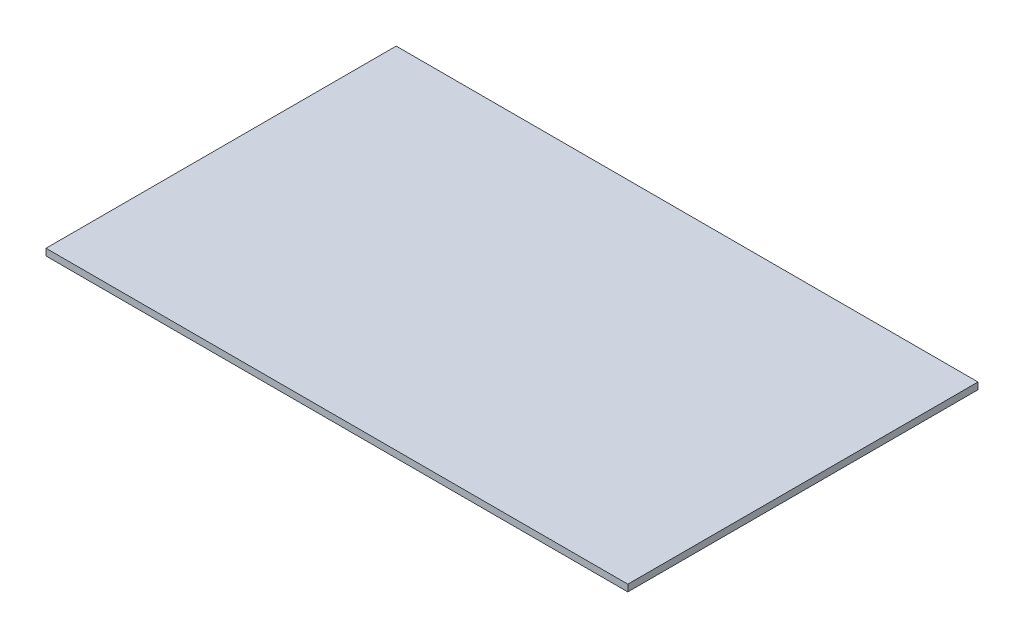
ISO-10303-21;
HEADER;
FILE_DESCRIPTION(('STEP AP214'),'2;1');
FILE_NAME('part.step','',(''),(''),'','','');
FILE_SCHEMA(('AUTOMOTIVE_DESIGN { 1 0 10303 214 1 1 1 1 }'));
ENDSEC;
DATA;
#1=APPLICATION_CONTEXT('core data for automotive mechanical design processes');
#2=APPLICATION_PROTOCOL_DEFINITION('international standard','automotive_design',2000,#1);
#3=PRODUCT_CONTEXT('',#1,'mechanical');
#4=PRODUCT('Part','Part','',(#3));
#5=PRODUCT_RELATED_PRODUCT_CATEGORY('part','',(#4));
#6=PRODUCT_DEFINITION_FORMATION('','',#4);
#7=PRODUCT_DEFINITION_CONTEXT('part definition',#1,'design');
#8=PRODUCT_DEFINITION('design','',#6,#7);
#9=PRODUCT_DEFINITION_SHAPE('','',#8);
#10=(LENGTH_UNIT() NAMED_UNIT(*) SI_UNIT(.MILLI.,.METRE.));
#11=(NAMED_UNIT(*) PLANE_ANGLE_UNIT() SI_UNIT($,.RADIAN.));
#12=(NAMED_UNIT(*) SI_UNIT($,.STERADIAN.) SOLID_ANGLE_UNIT());
#13=UNCERTAINTY_MEASURE_WITH_UNIT(LENGTH_MEASURE(1.E-05),#10,'distance_accuracy_value','');
#14=(GEOMETRIC_REPRESENTATION_CONTEXT(3) GLOBAL_UNCERTAINTY_ASSIGNED_CONTEXT((#13)) GLOBAL_UNIT_ASSIGNED_CONTEXT((#10,
#11,#12)) REPRESENTATION_CONTEXT('',''));
#15=CARTESIAN_POINT('',(0.,0.,0.));
#16=DIRECTION('',(0.,0.,1.));
#17=DIRECTION('',(1.,0.,0.));
#18=AXIS2_PLACEMENT_3D('',#15,#16,#17);
#19=CARTESIAN_POINT('',(-30.1173044030339,1.,-7.94881235154395));
#20=DIRECTION('',(1.,0.,0.));
#21=DIRECTION('',(0.,0.,-1.));
#22=AXIS2_PLACEMENT_3D('',#19,#20,#21);
#23=PLANE('',#22);
#24=DIRECTION('',(0.,0.,1.));
#25=VECTOR('',#24,1.);
#26=CARTESIAN_POINT('',(-30.1173044030339,0.,-7.94881235154395));
#27=LINE('',#26,#25);
#28=CARTESIAN_POINT('',(-30.1173044030339,0.,-7.94881235154395));
#29=VERTEX_POINT('',#28);
#30=CARTESIAN_POINT('',(-30.1173044030339,0.,44.0511876484561));
#31=VERTEX_POINT('',#30);
#32=EDGE_CURVE('E99',#29,#31,#27,.T.);
#33=ORIENTED_EDGE('',*,*,#32,.T.);
#34=DIRECTION('',(0.,-1.,0.));
#35=VECTOR('',#34,1.);
#36=CARTESIAN_POINT('',(-30.1173044030339,1.,44.0511876484561));
#37=LINE('',#36,#35);
#38=CARTESIAN_POINT('',(-30.1173044030339,1.,44.0511876484561));
#39=VERTEX_POINT('',#38);
#40=EDGE_CURVE('E11',#39,#31,#37,.T.);
#41=ORIENTED_EDGE('',*,*,#40,.F.);
#42=DIRECTION('',(0.,0.,1.));
#43=VECTOR('',#42,1.);
#44=CARTESIAN_POINT('',(-30.1173044030339,1.,-7.94881235154395));
#45=LINE('',#44,#43);
#46=CARTESIAN_POINT('',(-30.1173044030339,1.,-7.94881235154395));
#47=VERTEX_POINT('',#46);
#48=EDGE_CURVE('E87',#47,#39,#45,.T.);
#49=ORIENTED_EDGE('',*,*,#48,.F.);
#50=DIRECTION('',(0.,-1.,0.));
#51=VECTOR('',#50,1.);
#52=CARTESIAN_POINT('',(-30.1173044030339,1.,-7.94881235154395));
#53=LINE('',#52,#51);
#54=EDGE_CURVE('E95',#47,#29,#53,.T.);
#55=ORIENTED_EDGE('',*,*,#54,.T.);
#56=EDGE_LOOP('',(#33,#41,#49,#55));
#57=FACE_BOUND('',#56,.T.);
#58=ADVANCED_FACE('F36',(#57),#23,.F.);
#59=CARTESIAN_POINT('',(-30.1173044030339,1.,44.0511876484561));
#60=DIRECTION('',(0.,0.,-1.));
#61=DIRECTION('',(-1.,0.,0.));
#62=AXIS2_PLACEMENT_3D('',#59,#60,#61);
#63=PLANE('',#62);
#64=DIRECTION('',(1.,0.,0.));
#65=VECTOR('',#64,1.);
#66=CARTESIAN_POINT('',(-30.1173044030339,0.,44.0511876484561));
#67=LINE('',#66,#65);
#68=CARTESIAN_POINT('',(56.2826955969661,0.,44.0511876484561));
#69=VERTEX_POINT('',#68);
#70=EDGE_CURVE('E91',#31,#69,#67,.T.);
#71=ORIENTED_EDGE('',*,*,#70,.T.);
#72=DIRECTION('',(0.,-1.,0.));
#73=VECTOR('',#72,1.);
#74=CARTESIAN_POINT('',(56.2826955969661,1.,44.0511876484561));
#75=LINE('',#74,#73);
#76=CARTESIAN_POINT('',(56.2826955969661,1.,44.0511876484561));
#77=VERTEX_POINT('',#76);
#78=EDGE_CURVE('E44',#77,#69,#75,.T.);
#79=ORIENTED_EDGE('',*,*,#78,.F.);
#80=DIRECTION('',(1.,0.,0.));
#81=VECTOR('',#80,1.);
#82=CARTESIAN_POINT('',(-30.1173044030339,1.,44.0511876484561));
#83=LINE('',#82,#81);
#84=EDGE_CURVE('E82',#39,#77,#83,.T.);
#85=ORIENTED_EDGE('',*,*,#84,.F.);
#86=ORIENTED_EDGE('',*,*,#40,.T.);
#87=EDGE_LOOP('',(#71,#79,#85,#86));
#88=FACE_BOUND('',#87,.T.);
#89=ADVANCED_FACE('F90',(#88),#63,.F.);
#90=CARTESIAN_POINT('',(56.2826955969661,1.,-7.94881235154395));
#91=DIRECTION('',(-1.,0.,0.));
#92=DIRECTION('',(0.,0.,1.));
#93=AXIS2_PLACEMENT_3D('',#90,#91,#92);
#94=PLANE('',#93);
#95=DIRECTION('',(0.,0.,-1.));
#96=VECTOR('',#95,1.);
#97=CARTESIAN_POINT('',(56.2826955969661,0.,-7.94881235154395));
#98=LINE('',#97,#96);
#99=CARTESIAN_POINT('',(56.2826955969661,0.,-7.94881235154395));
#100=VERTEX_POINT('',#99);
#101=EDGE_CURVE('E69',#69,#100,#98,.T.);
#102=ORIENTED_EDGE('',*,*,#101,.T.);
#103=DIRECTION('',(0.,-1.,0.));
#104=VECTOR('',#103,1.);
#105=CARTESIAN_POINT('',(56.2826955969661,1.,-7.94881235154395));
#106=LINE('',#105,#104);
#107=CARTESIAN_POINT('',(56.2826955969661,1.,-7.94881235154395));
#108=VERTEX_POINT('',#107);
#109=EDGE_CURVE('E92',#108,#100,#106,.T.);
#110=ORIENTED_EDGE('',*,*,#109,.F.);
#111=DIRECTION('',(0.,0.,-1.));
#112=VECTOR('',#111,1.);
#113=CARTESIAN_POINT('',(56.2826955969661,1.,-7.94881235154395));
#114=LINE('',#113,#112);
#115=EDGE_CURVE('E85',#77,#108,#114,.T.);
#116=ORIENTED_EDGE('',*,*,#115,.F.);
#117=ORIENTED_EDGE('',*,*,#78,.T.);
#118=EDGE_LOOP('',(#102,#110,#116,#117));
#119=FACE_BOUND('',#118,.T.);
#120=ADVANCED_FACE('F93',(#119),#94,.F.);
#121=CARTESIAN_POINT('',(-30.1173044030339,1.,-7.94881235154395));
#122=DIRECTION('',(0.,0.,1.));
#123=DIRECTION('',(1.,0.,0.));
#124=AXIS2_PLACEMENT_3D('',#121,#122,#123);
#125=PLANE('',#124);
#126=DIRECTION('',(-1.,0.,0.));
#127=VECTOR('',#126,1.);
#128=CARTESIAN_POINT('',(-30.1173044030339,0.,-7.94881235154395));
#129=LINE('',#128,#127);
#130=EDGE_CURVE('E75',#100,#29,#129,.T.);
#131=ORIENTED_EDGE('',*,*,#130,.T.);
#132=ORIENTED_EDGE('',*,*,#54,.F.);
#133=DIRECTION('',(-1.,0.,0.));
#134=VECTOR('',#133,1.);
#135=CARTESIAN_POINT('',(-30.1173044030339,1.,-7.94881235154395));
#136=LINE('',#135,#134);
#137=EDGE_CURVE('E52',#108,#47,#136,.T.);
#138=ORIENTED_EDGE('',*,*,#137,.F.);
#139=ORIENTED_EDGE('',*,*,#109,.T.);
#140=EDGE_LOOP('',(#131,#132,#138,#139));
#141=FACE_BOUND('',#140,.T.);
#142=ADVANCED_FACE('F106',(#141),#125,.F.);
#143=CARTESIAN_POINT('',(0.,1.,0.));
#144=DIRECTION('',(0.,1.,0.));
#145=DIRECTION('',(0.,0.,1.));
#146=AXIS2_PLACEMENT_3D('',#143,#144,#145);
#147=PLANE('',#146);
#148=ORIENTED_EDGE('',*,*,#48,.T.);
#149=ORIENTED_EDGE('',*,*,#84,.T.);
#150=ORIENTED_EDGE('',*,*,#115,.T.);
#151=ORIENTED_EDGE('',*,*,#137,.T.);
#152=EDGE_LOOP('',(#148,#149,#150,#151));
#153=FACE_BOUND('',#152,.T.);
#154=ADVANCED_FACE('F83',(#153),#147,.T.);
#155=CARTESIAN_POINT('',(0.,0.,0.));
#156=DIRECTION('',(0.,1.,0.));
#157=DIRECTION('',(0.,0.,1.));
#158=AXIS2_PLACEMENT_3D('',#155,#156,#157);
#159=PLANE('',#158);
#160=ORIENTED_EDGE('',*,*,#32,.F.);
#161=ORIENTED_EDGE('',*,*,#130,.F.);
#162=ORIENTED_EDGE('',*,*,#101,.F.);
#163=ORIENTED_EDGE('',*,*,#70,.F.);
#164=EDGE_LOOP('',(#160,#161,#162,#163));
#165=FACE_BOUND('',#164,.T.);
#166=ADVANCED_FACE('F109',(#165),#159,.F.);
#167=CLOSED_SHELL('',(#58,#89,#120,#142,#154,#166));
#168=MANIFOLD_SOLID_BREP('B2',#167);
#169=ADVANCED_BREP_SHAPE_REPRESENTATION('',(#18,#168),#14);
#170=SHAPE_DEFINITION_REPRESENTATION(#9,#169);
ENDSEC;
END-ISO-10303-21;
